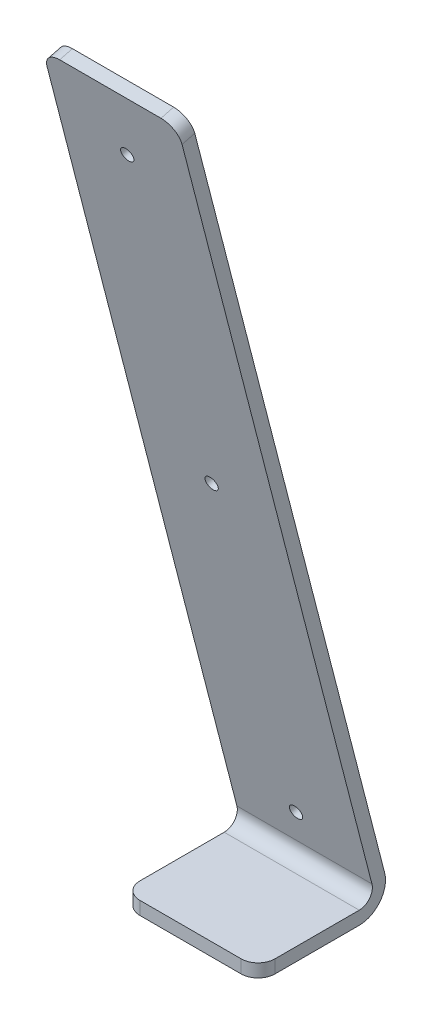
ISO-10303-21;
HEADER;
FILE_DESCRIPTION(('STEP AP214'),'2;1');
FILE_NAME('part.step','',(''),(''),'','','');
FILE_SCHEMA(('AUTOMOTIVE_DESIGN { 1 0 10303 214 1 1 1 1 }'));
ENDSEC;
DATA;
#1=APPLICATION_CONTEXT('core data for automotive mechanical design processes');
#2=APPLICATION_PROTOCOL_DEFINITION('international standard','automotive_design',2000,#1);
#3=PRODUCT_CONTEXT('',#1,'mechanical');
#4=PRODUCT('Part','Part','',(#3));
#5=PRODUCT_RELATED_PRODUCT_CATEGORY('part','',(#4));
#6=PRODUCT_DEFINITION_FORMATION('','',#4);
#7=PRODUCT_DEFINITION_CONTEXT('part definition',#1,'design');
#8=PRODUCT_DEFINITION('design','',#6,#7);
#9=PRODUCT_DEFINITION_SHAPE('','',#8);
#10=(LENGTH_UNIT() NAMED_UNIT(*) SI_UNIT(.MILLI.,.METRE.));
#11=(NAMED_UNIT(*) PLANE_ANGLE_UNIT() SI_UNIT($,.RADIAN.));
#12=(NAMED_UNIT(*) SI_UNIT($,.STERADIAN.) SOLID_ANGLE_UNIT());
#13=UNCERTAINTY_MEASURE_WITH_UNIT(LENGTH_MEASURE(1.E-05),#10,'distance_accuracy_value','');
#14=(GEOMETRIC_REPRESENTATION_CONTEXT(3) GLOBAL_UNCERTAINTY_ASSIGNED_CONTEXT((#13)) GLOBAL_UNIT_ASSIGNED_CONTEXT((#10,
#11,#12)) REPRESENTATION_CONTEXT('',''));
#15=CARTESIAN_POINT('',(0.,0.,0.));
#16=DIRECTION('',(0.,0.,1.));
#17=DIRECTION('',(1.,0.,0.));
#18=AXIS2_PLACEMENT_3D('',#15,#16,#17);
#19=CARTESIAN_POINT('',(-25.4,0.,-25.4));
#20=DIRECTION('',(0.,-1.,0.));
#21=DIRECTION('',(0.,0.,-1.));
#22=AXIS2_PLACEMENT_3D('',#19,#20,#21);
#23=PLANE('',#22);
#24=DIRECTION('',(0.,0.,1.));
#25=VECTOR('',#24,1.);
#26=CARTESIAN_POINT('',(25.4,0.,-49.2071645941862));
#27=LINE('',#26,#25);
#28=CARTESIAN_POINT('',(25.4,0.,-63.4573167534134));
#29=VERTEX_POINT('',#28);
#30=CARTESIAN_POINT('',(25.4,0.,-31.75));
#31=VERTEX_POINT('',#30);
#32=EDGE_CURVE('E108',#29,#31,#27,.T.);
#33=ORIENTED_EDGE('',*,*,#32,.T.);
#34=CARTESIAN_POINT('',(19.05,0.,-31.75));
#35=DIRECTION('',(0.,-1.,0.));
#36=DIRECTION('',(0.,0.,-1.));
#37=AXIS2_PLACEMENT_3D('',#34,#35,#36);
#38=CIRCLE('',#37,6.35);
#39=CARTESIAN_POINT('',(19.05,0.,-25.4));
#40=VERTEX_POINT('',#39);
#41=EDGE_CURVE('E20',#40,#31,#38,.F.);
#42=ORIENTED_EDGE('',*,*,#41,.F.);
#43=DIRECTION('',(-1.,0.,0.));
#44=VECTOR('',#43,1.);
#45=CARTESIAN_POINT('',(0.,0.,-25.4));
#46=LINE('',#45,#44);
#47=CARTESIAN_POINT('',(-19.05,0.,-25.4));
#48=VERTEX_POINT('',#47);
#49=EDGE_CURVE('E105',#40,#48,#46,.T.);
#50=ORIENTED_EDGE('',*,*,#49,.T.);
#51=CARTESIAN_POINT('',(-19.05,0.,-31.75));
#52=DIRECTION('',(0.,-1.,0.));
#53=DIRECTION('',(0.,0.,-1.));
#54=AXIS2_PLACEMENT_3D('',#51,#52,#53);
#55=CIRCLE('',#54,6.35);
#56=CARTESIAN_POINT('',(-25.4,0.,-31.75));
#57=VERTEX_POINT('',#56);
#58=EDGE_CURVE('E184',#57,#48,#55,.F.);
#59=ORIENTED_EDGE('',*,*,#58,.F.);
#60=DIRECTION('',(0.,0.,1.));
#61=VECTOR('',#60,1.);
#62=CARTESIAN_POINT('',(-25.4,0.,-49.2071645941862));
#63=LINE('',#62,#61);
#64=CARTESIAN_POINT('',(-25.4,0.,-63.4573167534134));
#65=VERTEX_POINT('',#64);
#66=EDGE_CURVE('E128',#65,#57,#63,.T.);
#67=ORIENTED_EDGE('',*,*,#66,.F.);
#68=DIRECTION('',(-1.,0.,0.));
#69=VECTOR('',#68,1.);
#70=CARTESIAN_POINT('',(-25.4,0.,-63.4573167534134));
#71=LINE('',#70,#69);
#72=EDGE_CURVE('E183',#29,#65,#71,.T.);
#73=ORIENTED_EDGE('',*,*,#72,.F.);
#74=EDGE_LOOP('',(#33,#42,#50,#59,#67,#73));
#75=FACE_BOUND('',#74,.T.);
#76=ADVANCED_FACE('F17',(#75),#23,.T.);
#77=CARTESIAN_POINT('',(19.05,608.96212742002,-31.75));
#78=DIRECTION('',(0.,-1.,0.));
#79=DIRECTION('',(0.,0.,-1.));
#80=AXIS2_PLACEMENT_3D('',#77,#78,#79);
#81=CYLINDRICAL_SURFACE('',#80,6.35);
#82=DIRECTION('',(0.,1.,0.));
#83=VECTOR('',#82,1.);
#84=CARTESIAN_POINT('',(19.05,2.46761,-25.4));
#85=LINE('',#84,#83);
#86=CARTESIAN_POINT('',(19.05,4.93522000000001,-25.4));
#87=VERTEX_POINT('',#86);
#88=EDGE_CURVE('E113',#87,#40,#85,.F.);
#89=ORIENTED_EDGE('',*,*,#88,.T.);
#90=ORIENTED_EDGE('',*,*,#41,.T.);
#91=DIRECTION('',(0.,1.,0.));
#92=VECTOR('',#91,1.);
#93=CARTESIAN_POINT('',(25.4,2.46761,-31.75));
#94=LINE('',#93,#92);
#95=CARTESIAN_POINT('',(25.4,4.93522000000001,-31.75));
#96=VERTEX_POINT('',#95);
#97=EDGE_CURVE('E129',#31,#96,#94,.T.);
#98=ORIENTED_EDGE('',*,*,#97,.T.);
#99=CARTESIAN_POINT('',(19.05,4.93522000000002,-31.75));
#100=DIRECTION('',(0.,-1.,0.));
#101=DIRECTION('',(0.,0.,-1.));
#102=AXIS2_PLACEMENT_3D('',#99,#100,#101);
#103=CIRCLE('',#102,6.35);
#104=EDGE_CURVE('E123',#96,#87,#103,.T.);
#105=ORIENTED_EDGE('',*,*,#104,.T.);
#106=EDGE_LOOP('',(#89,#90,#98,#105));
#107=FACE_BOUND('',#106,.T.);
#108=ADVANCED_FACE('F122',(#107),#81,.T.);
#109=CARTESIAN_POINT('',(0.,2.46761,-25.4));
#110=DIRECTION('',(0.,0.,-1.));
#111=DIRECTION('',(-1.,0.,0.));
#112=AXIS2_PLACEMENT_3D('',#109,#110,#111);
#113=PLANE('',#112);
#114=DIRECTION('',(0.,-1.,0.));
#115=VECTOR('',#114,1.);
#116=CARTESIAN_POINT('',(-19.05,608.694350914172,-25.4));
#117=LINE('',#116,#115);
#118=CARTESIAN_POINT('',(-19.05,4.93522000000001,-25.4));
#119=VERTEX_POINT('',#118);
#120=EDGE_CURVE('E119',#48,#119,#117,.F.);
#121=ORIENTED_EDGE('',*,*,#120,.F.);
#122=ORIENTED_EDGE('',*,*,#49,.F.);
#123=ORIENTED_EDGE('',*,*,#88,.F.);
#124=DIRECTION('',(1.,0.,0.));
#125=VECTOR('',#124,1.);
#126=CARTESIAN_POINT('',(-25.4,4.93522,-25.4));
#127=LINE('',#126,#125);
#128=EDGE_CURVE('E180',#87,#119,#127,.F.);
#129=ORIENTED_EDGE('',*,*,#128,.T.);
#130=EDGE_LOOP('',(#121,#122,#123,#129));
#131=FACE_BOUND('',#130,.T.);
#132=ADVANCED_FACE('F116',(#131),#113,.F.);
#133=CARTESIAN_POINT('',(-19.05,608.694350914172,-31.75));
#134=DIRECTION('',(0.,-1.,0.));
#135=DIRECTION('',(0.,0.,-1.));
#136=AXIS2_PLACEMENT_3D('',#133,#134,#135);
#137=CYLINDRICAL_SURFACE('',#136,6.35);
#138=DIRECTION('',(0.,1.,0.));
#139=VECTOR('',#138,1.);
#140=CARTESIAN_POINT('',(-25.4,2.46761,-31.75));
#141=LINE('',#140,#139);
#142=CARTESIAN_POINT('',(-25.4,4.93522000000001,-31.75));
#143=VERTEX_POINT('',#142);
#144=EDGE_CURVE('E201',#57,#143,#141,.T.);
#145=ORIENTED_EDGE('',*,*,#144,.F.);
#146=ORIENTED_EDGE('',*,*,#58,.T.);
#147=ORIENTED_EDGE('',*,*,#120,.T.);
#148=CARTESIAN_POINT('',(-19.05,4.93522000000002,-31.75));
#149=DIRECTION('',(0.,-1.,0.));
#150=DIRECTION('',(0.,0.,-1.));
#151=AXIS2_PLACEMENT_3D('',#148,#149,#150);
#152=CIRCLE('',#151,6.35);
#153=EDGE_CURVE('E176',#119,#143,#152,.T.);
#154=ORIENTED_EDGE('',*,*,#153,.T.);
#155=EDGE_LOOP('',(#145,#146,#147,#154));
#156=FACE_BOUND('',#155,.T.);
#157=ADVANCED_FACE('F189',(#156),#137,.T.);
#158=CARTESIAN_POINT('',(-25.4,9.87044,-63.4573167534134));
#159=DIRECTION('',(-1.,0.,0.));
#160=DIRECTION('',(0.,0.,1.));
#161=AXIS2_PLACEMENT_3D('',#158,#159,#160);
#162=CYLINDRICAL_SURFACE('',#161,9.87044);
#163=CARTESIAN_POINT('',(-25.4,9.87044,-63.4573167534134));
#164=DIRECTION('',(-1.,0.,0.));
#165=DIRECTION('',(0.,0.,1.));
#166=AXIS2_PLACEMENT_3D('',#163,#164,#165);
#167=CIRCLE('',#166,9.87044);
#168=CARTESIAN_POINT('',(-25.4,12.3380500000012,-73.0143291883508));
#169=VERTEX_POINT('',#168);
#170=EDGE_CURVE('E172',#65,#169,#167,.F.);
#171=ORIENTED_EDGE('',*,*,#170,.T.);
#172=DIRECTION('',(1.,0.,0.));
#173=VECTOR('',#172,1.);
#174=CARTESIAN_POINT('',(-25.4,12.338050000002,-73.0143291883547));
#175=LINE('',#174,#173);
#176=CARTESIAN_POINT('',(25.4,12.3380500000012,-73.0143291883508));
#177=VERTEX_POINT('',#176);
#178=EDGE_CURVE('E171',#177,#169,#175,.F.);
#179=ORIENTED_EDGE('',*,*,#178,.F.);
#180=CARTESIAN_POINT('',(25.4,9.87044,-63.4573167534134));
#181=DIRECTION('',(-1.,0.,0.));
#182=DIRECTION('',(0.,0.,1.));
#183=AXIS2_PLACEMENT_3D('',#180,#181,#182);
#184=CIRCLE('',#183,9.87044);
#185=EDGE_CURVE('E182',#29,#177,#184,.F.);
#186=ORIENTED_EDGE('',*,*,#185,.F.);
#187=ORIENTED_EDGE('',*,*,#72,.T.);
#188=EDGE_LOOP('',(#171,#179,#186,#187));
#189=FACE_BOUND('',#188,.T.);
#190=ADVANCED_FACE('F212',(#189),#162,.T.);
#191=CARTESIAN_POINT('',(-25.4,4.93522,-25.4));
#192=DIRECTION('',(0.,-1.,0.));
#193=DIRECTION('',(0.,0.,-1.));
#194=AXIS2_PLACEMENT_3D('',#191,#192,#193);
#195=PLANE('',#194);
#196=DIRECTION('',(-1.,0.,0.));
#197=VECTOR('',#196,1.);
#198=CARTESIAN_POINT('',(-25.4,4.93522,-63.4573167534134));
#199=LINE('',#198,#197);
#200=CARTESIAN_POINT('',(25.4,4.93522,-63.4573167534134));
#201=VERTEX_POINT('',#200);
#202=CARTESIAN_POINT('',(-25.4,4.93522,-63.4573167534134));
#203=VERTEX_POINT('',#202);
#204=EDGE_CURVE('E163',#201,#203,#199,.T.);
#205=ORIENTED_EDGE('',*,*,#204,.T.);
#206=DIRECTION('',(0.,0.,-1.));
#207=VECTOR('',#206,1.);
#208=CARTESIAN_POINT('',(-25.4,4.93522,-25.4));
#209=LINE('',#208,#207);
#210=EDGE_CURVE('E179',#143,#203,#209,.T.);
#211=ORIENTED_EDGE('',*,*,#210,.F.);
#212=ORIENTED_EDGE('',*,*,#153,.F.);
#213=ORIENTED_EDGE('',*,*,#128,.F.);
#214=ORIENTED_EDGE('',*,*,#104,.F.);
#215=DIRECTION('',(0.,0.,-1.));
#216=VECTOR('',#215,1.);
#217=CARTESIAN_POINT('',(25.4,4.93522,-25.4));
#218=LINE('',#217,#216);
#219=EDGE_CURVE('E175',#201,#96,#218,.F.);
#220=ORIENTED_EDGE('',*,*,#219,.F.);
#221=EDGE_LOOP('',(#205,#211,#212,#213,#214,#220));
#222=FACE_BOUND('',#221,.T.);
#223=ADVANCED_FACE('F193',(#222),#195,.F.);
#224=CARTESIAN_POINT('',(-25.4,0.,-76.2));
#225=DIRECTION('',(0.,0.249999999999989,-0.968245836551857));
#226=DIRECTION('',(0.,0.968245836551857,0.249999999999989));
#227=AXIS2_PLACEMENT_3D('',#224,#225,#226);
#228=PLANE('',#227);
#229=CARTESIAN_POINT('',(0.,270.52788673258,-6.35000000000626));
#230=DIRECTION('',(0.,-0.249999999999989,0.968245836551857));
#231=DIRECTION('',(0.,-0.968245836551857,-0.249999999999989));
#232=AXIS2_PLACEMENT_3D('',#229,#230,#231);
#233=CIRCLE('',#232,2.4384);
#234=CARTESIAN_POINT('',(0.,268.166916084732,-6.95960000000624));
#235=VERTEX_POINT('',#234);
#236=EDGE_CURVE('E145',#235,#235,#233,.T.);
#237=ORIENTED_EDGE('',*,*,#236,.T.);
#238=EDGE_LOOP('',(#237));
#239=FACE_BOUND('',#238,.T.);
#240=CARTESIAN_POINT('',(0.,147.560665490499,-38.1000000000001));
#241=DIRECTION('',(0.,-0.249999999999989,0.968245836551857));
#242=DIRECTION('',(0.,-0.968245836551857,-0.249999999999989));
#243=AXIS2_PLACEMENT_3D('',#240,#241,#242);
#244=CIRCLE('',#243,2.4384);
#245=CARTESIAN_POINT('',(0.,145.199694842651,-38.7096000000001));
#246=VERTEX_POINT('',#245);
#247=EDGE_CURVE('E148',#246,#246,#244,.T.);
#248=ORIENTED_EDGE('',*,*,#247,.T.);
#249=EDGE_LOOP('',(#248));
#250=FACE_BOUND('',#249,.T.);
#251=CARTESIAN_POINT('',(0.,24.5934442484184,-69.8500000000007));
#252=DIRECTION('',(0.,-0.249999999999989,0.968245836551857));
#253=DIRECTION('',(0.,-0.968245836551857,-0.249999999999989));
#254=AXIS2_PLACEMENT_3D('',#251,#252,#253);
#255=CIRCLE('',#254,2.4384);
#256=CARTESIAN_POINT('',(0.,22.2324736005704,-70.4596000000007));
#257=VERTEX_POINT('',#256);
#258=EDGE_CURVE('E151',#257,#257,#255,.T.);
#259=ORIENTED_EDGE('',*,*,#258,.T.);
#260=EDGE_LOOP('',(#259));
#261=FACE_BOUND('',#260,.T.);
#262=DIRECTION('',(1.,0.,0.));
#263=VECTOR('',#262,1.);
#264=CARTESIAN_POINT('',(0.,295.121330980948,0.));
#265=LINE('',#264,#263);
#266=CARTESIAN_POINT('',(19.05,295.121330980946,6.18363867055383E-12));
#267=VERTEX_POINT('',#266);
#268=CARTESIAN_POINT('',(-19.05,295.121330980948,0.));
#269=VERTEX_POINT('',#268);
#270=EDGE_CURVE('E158',#267,#269,#265,.F.);
#271=ORIENTED_EDGE('',*,*,#270,.F.);
#272=CARTESIAN_POINT('',(19.05,288.972969918923,-1.58749999996624));
#273=DIRECTION('',(0.,0.249999999999989,-0.968245836551857));
#274=DIRECTION('',(0.,0.968245836551857,0.249999999999989));
#275=AXIS2_PLACEMENT_3D('',#272,#273,#274);
#276=CIRCLE('',#275,6.35);
#277=CARTESIAN_POINT('',(25.4,288.972969918857,-1.58749999998316));
#278=VERTEX_POINT('',#277);
#279=EDGE_CURVE('E168',#278,#267,#276,.F.);
#280=ORIENTED_EDGE('',*,*,#279,.F.);
#281=DIRECTION('',(0.,-0.968245836551837,-0.250000000000066));
#282=VECTOR('',#281,1.);
#283=CARTESIAN_POINT('',(25.4,288.972969918792,-1.5875));
#284=LINE('',#283,#282);
#285=EDGE_CURVE('E167',#278,#177,#284,.T.);
#286=ORIENTED_EDGE('',*,*,#285,.T.);
#287=ORIENTED_EDGE('',*,*,#178,.T.);
#288=DIRECTION('',(0.,-0.968245836551837,-0.250000000000066));
#289=VECTOR('',#288,1.);
#290=CARTESIAN_POINT('',(-25.4,288.972969918792,-1.5875));
#291=LINE('',#290,#289);
#292=CARTESIAN_POINT('',(-25.4,288.972969918859,-1.58749999998934));
#293=VERTEX_POINT('',#292);
#294=EDGE_CURVE('E162',#293,#169,#291,.T.);
#295=ORIENTED_EDGE('',*,*,#294,.F.);
#296=CARTESIAN_POINT('',(-19.05,288.972969918926,-1.58749999997866));
#297=DIRECTION('',(0.,0.249999999999989,-0.968245836551857));
#298=DIRECTION('',(0.,0.968245836551857,0.249999999999989));
#299=AXIS2_PLACEMENT_3D('',#296,#297,#298);
#300=CIRCLE('',#299,6.35);
#301=EDGE_CURVE('E155',#269,#293,#300,.F.);
#302=ORIENTED_EDGE('',*,*,#301,.F.);
#303=EDGE_LOOP('',(#271,#280,#286,#287,#295,#302));
#304=FACE_BOUND('',#303,.T.);
#305=ADVANCED_FACE('F345',(#239,#250,#261,#304),#228,.T.);
#306=CARTESIAN_POINT('',(19.05,260.313805510286,109.408966470911));
#307=DIRECTION('',(0.,0.249999999999989,-0.968245836551857));
#308=DIRECTION('',(0.,0.968245836551857,0.249999999999989));
#309=AXIS2_PLACEMENT_3D('',#306,#307,#308);
#310=CYLINDRICAL_SURFACE('',#309,6.35);
#311=DIRECTION('',(0.,0.250000000000027,-0.968245836551847));
#312=VECTOR('',#311,1.);
#313=CARTESIAN_POINT('',(25.4,287.739164918792,3.1910062174668));
#314=LINE('',#313,#312);
#315=CARTESIAN_POINT('',(25.4,287.739164918863,3.19100621746266));
#316=VERTEX_POINT('',#315);
#317=EDGE_CURVE('E170',#316,#278,#314,.T.);
#318=ORIENTED_EDGE('',*,*,#317,.T.);
#319=ORIENTED_EDGE('',*,*,#279,.T.);
#320=DIRECTION('',(0.,-0.249999999999989,0.968245836551857));
#321=VECTOR('',#320,1.);
#322=CARTESIAN_POINT('',(19.05,294.504428480948,2.38925310873365));
#323=LINE('',#322,#321);
#324=CARTESIAN_POINT('',(19.05,293.88752598095,4.7785062174582));
#325=VERTEX_POINT('',#324);
#326=EDGE_CURVE('E154',#325,#267,#323,.F.);
#327=ORIENTED_EDGE('',*,*,#326,.F.);
#328=CARTESIAN_POINT('',(19.05,287.739164918926,3.19100621748819));
#329=DIRECTION('',(0.,0.249999999999989,-0.968245836551857));
#330=DIRECTION('',(0.,0.968245836551857,0.249999999999989));
#331=AXIS2_PLACEMENT_3D('',#328,#329,#330);
#332=CIRCLE('',#331,6.35);
#333=EDGE_CURVE('E141',#325,#316,#332,.T.);
#334=ORIENTED_EDGE('',*,*,#333,.T.);
#335=EDGE_LOOP('',(#318,#319,#327,#334));
#336=FACE_BOUND('',#335,.T.);
#337=ADVANCED_FACE('F258',(#336),#310,.T.);
#338=CARTESIAN_POINT('',(25.4,148.486019240499,-35.3125380398068));
#339=DIRECTION('',(-1.,0.,0.));
#340=DIRECTION('',(0.,0.,1.));
#341=AXIS2_PLACEMENT_3D('',#338,#339,#340);
#342=PLANE('',#341);
#343=DIRECTION('',(0.,0.968245836551857,0.249999999999989));
#344=VECTOR('',#343,1.);
#345=CARTESIAN_POINT('',(25.4,-1.233805,-71.4214937825332));
#346=LINE('',#345,#344);
#347=CARTESIAN_POINT('',(25.4,11.104245000001,-68.2358229708844));
#348=VERTEX_POINT('',#347);
#349=EDGE_CURVE('E144',#316,#348,#346,.F.);
#350=ORIENTED_EDGE('',*,*,#349,.T.);
#351=CARTESIAN_POINT('',(25.4,9.87044,-63.4573167534134));
#352=DIRECTION('',(-1.,0.,0.));
#353=DIRECTION('',(0.,0.,1.));
#354=AXIS2_PLACEMENT_3D('',#351,#352,#353);
#355=CIRCLE('',#354,4.93522);
#356=EDGE_CURVE('E164',#348,#201,#355,.T.);
#357=ORIENTED_EDGE('',*,*,#356,.T.);
#358=ORIENTED_EDGE('',*,*,#219,.T.);
#359=ORIENTED_EDGE('',*,*,#97,.F.);
#360=ORIENTED_EDGE('',*,*,#32,.F.);
#361=ORIENTED_EDGE('',*,*,#185,.T.);
#362=ORIENTED_EDGE('',*,*,#285,.F.);
#363=ORIENTED_EDGE('',*,*,#317,.F.);
#364=EDGE_LOOP('',(#350,#357,#358,#359,#360,#361,#362,#363));
#365=FACE_BOUND('',#364,.T.);
#366=ADVANCED_FACE('F216',(#365),#342,.F.);
#367=CARTESIAN_POINT('',(-25.4,9.87044,-63.4573167534134));
#368=DIRECTION('',(-1.,0.,0.));
#369=DIRECTION('',(0.,0.,1.));
#370=AXIS2_PLACEMENT_3D('',#367,#368,#369);
#371=CYLINDRICAL_SURFACE('',#370,4.93522);
#372=ORIENTED_EDGE('',*,*,#204,.F.);
#373=ORIENTED_EDGE('',*,*,#356,.F.);
#374=DIRECTION('',(1.,0.,0.));
#375=VECTOR('',#374,1.);
#376=CARTESIAN_POINT('',(-25.4,11.104245000002,-68.2358229708879));
#377=LINE('',#376,#375);
#378=CARTESIAN_POINT('',(-25.4,11.104245000001,-68.2358229708844));
#379=VERTEX_POINT('',#378);
#380=EDGE_CURVE('E226',#348,#379,#377,.F.);
#381=ORIENTED_EDGE('',*,*,#380,.T.);
#382=CARTESIAN_POINT('',(-25.4,9.87044,-63.4573167534134));
#383=DIRECTION('',(-1.,0.,0.));
#384=DIRECTION('',(0.,0.,1.));
#385=AXIS2_PLACEMENT_3D('',#382,#383,#384);
#386=CIRCLE('',#385,4.93522);
#387=EDGE_CURVE('E160',#203,#379,#386,.F.);
#388=ORIENTED_EDGE('',*,*,#387,.F.);
#389=EDGE_LOOP('',(#372,#373,#381,#388));
#390=FACE_BOUND('',#389,.T.);
#391=ADVANCED_FACE('F249',(#390),#371,.F.);
#392=CARTESIAN_POINT('',(-25.4,148.486019240499,-35.3125380398068));
#393=DIRECTION('',(-1.,0.,0.));
#394=DIRECTION('',(0.,0.,1.));
#395=AXIS2_PLACEMENT_3D('',#392,#393,#394);
#396=PLANE('',#395);
#397=DIRECTION('',(0.,0.968245836551857,0.249999999999989));
#398=VECTOR('',#397,1.);
#399=CARTESIAN_POINT('',(-25.4,-1.233805,-71.4214937825332));
#400=LINE('',#399,#398);
#401=CARTESIAN_POINT('',(-25.4,287.739164918862,3.19100621746892));
#402=VERTEX_POINT('',#401);
#403=EDGE_CURVE('E140',#379,#402,#400,.T.);
#404=ORIENTED_EDGE('',*,*,#403,.T.);
#405=DIRECTION('',(0.,0.249999999999989,-0.968245836551857));
#406=VECTOR('',#405,1.);
#407=CARTESIAN_POINT('',(-25.4,260.313805510155,109.408966470877));
#408=LINE('',#407,#406);
#409=EDGE_CURVE('E159',#293,#402,#408,.F.);
#410=ORIENTED_EDGE('',*,*,#409,.F.);
#411=ORIENTED_EDGE('',*,*,#294,.T.);
#412=ORIENTED_EDGE('',*,*,#170,.F.);
#413=ORIENTED_EDGE('',*,*,#66,.T.);
#414=ORIENTED_EDGE('',*,*,#144,.T.);
#415=ORIENTED_EDGE('',*,*,#210,.T.);
#416=ORIENTED_EDGE('',*,*,#387,.T.);
#417=EDGE_LOOP('',(#404,#410,#411,#412,#413,#414,#415,#416));
#418=FACE_BOUND('',#417,.T.);
#419=ADVANCED_FACE('F204',(#418),#396,.T.);
#420=CARTESIAN_POINT('',(-19.05,260.313805510286,109.408966470911));
#421=DIRECTION('',(0.,0.249999999999989,-0.968245836551857));
#422=DIRECTION('',(0.,0.968245836551857,0.249999999999989));
#423=AXIS2_PLACEMENT_3D('',#420,#421,#422);
#424=CYLINDRICAL_SURFACE('',#423,6.35);
#425=DIRECTION('',(0.,-0.249999999999989,0.968245836551857));
#426=VECTOR('',#425,1.);
#427=CARTESIAN_POINT('',(-19.05,294.504428480948,2.38925310873365));
#428=LINE('',#427,#426);
#429=CARTESIAN_POINT('',(-19.05,293.887525980949,4.77850621746444));
#430=VERTEX_POINT('',#429);
#431=EDGE_CURVE('E35',#269,#430,#428,.T.);
#432=ORIENTED_EDGE('',*,*,#431,.F.);
#433=ORIENTED_EDGE('',*,*,#301,.T.);
#434=ORIENTED_EDGE('',*,*,#409,.T.);
#435=CARTESIAN_POINT('',(-19.05,287.739164918923,3.19100621750067));
#436=DIRECTION('',(0.,0.249999999999989,-0.968245836551857));
#437=DIRECTION('',(0.,0.968245836551857,0.249999999999989));
#438=AXIS2_PLACEMENT_3D('',#435,#436,#437);
#439=CIRCLE('',#438,6.35);
#440=EDGE_CURVE('E137',#402,#430,#439,.T.);
#441=ORIENTED_EDGE('',*,*,#440,.T.);
#442=EDGE_LOOP('',(#432,#433,#434,#441));
#443=FACE_BOUND('',#442,.T.);
#444=ADVANCED_FACE('F244',(#443),#424,.T.);
#445=CARTESIAN_POINT('',(0.,294.504428480948,2.38925310873365));
#446=DIRECTION('',(0.,0.968245836551857,0.249999999999989));
#447=DIRECTION('',(0.,-0.249999999999989,0.968245836551857));
#448=AXIS2_PLACEMENT_3D('',#445,#446,#447);
#449=PLANE('',#448);
#450=DIRECTION('',(1.,0.,0.));
#451=VECTOR('',#450,1.);
#452=CARTESIAN_POINT('',(-25.4,293.887525980952,4.77850621744957));
#453=LINE('',#452,#451);
#454=EDGE_CURVE('E136',#430,#325,#453,.T.);
#455=ORIENTED_EDGE('',*,*,#454,.T.);
#456=ORIENTED_EDGE('',*,*,#326,.T.);
#457=ORIENTED_EDGE('',*,*,#270,.T.);
#458=ORIENTED_EDGE('',*,*,#431,.T.);
#459=EDGE_LOOP('',(#455,#456,#457,#458));
#460=FACE_BOUND('',#459,.T.);
#461=ADVANCED_FACE('F235',(#460),#449,.T.);
#462=CARTESIAN_POINT('',(0.,24.5934442484183,-69.85));
#463=DIRECTION('',(0.,-0.249999999999989,0.968245836551857));
#464=DIRECTION('',(0.,-0.968245836551857,-0.249999999999989));
#465=AXIS2_PLACEMENT_3D('',#462,#463,#464);
#466=CYLINDRICAL_SURFACE('',#465,2.4384);
#467=CARTESIAN_POINT('',(0.,23.3596392484187,-65.0714937825339));
#468=DIRECTION('',(0.,-0.249999999999989,0.968245836551857));
#469=DIRECTION('',(0.,-0.968245836551857,-0.249999999999989));
#470=AXIS2_PLACEMENT_3D('',#467,#468,#469);
#471=CIRCLE('',#470,2.4384);
#472=CARTESIAN_POINT('',(0.,20.9986686005706,-65.6810937825338));
#473=VERTEX_POINT('',#472);
#474=EDGE_CURVE('E133',#473,#473,#471,.T.);
#475=ORIENTED_EDGE('',*,*,#474,.T.);
#476=EDGE_LOOP('',(#475));
#477=FACE_BOUND('',#476,.T.);
#478=ORIENTED_EDGE('',*,*,#258,.F.);
#479=EDGE_LOOP('',(#478));
#480=FACE_BOUND('',#479,.T.);
#481=ADVANCED_FACE('F275',(#477,#480),#466,.F.);
#482=CARTESIAN_POINT('',(0.,147.560665490499,-38.1));
#483=DIRECTION('',(0.,-0.249999999999989,0.968245836551857));
#484=DIRECTION('',(0.,-0.968245836551857,-0.249999999999989));
#485=AXIS2_PLACEMENT_3D('',#482,#483,#484);
#486=CYLINDRICAL_SURFACE('',#485,2.4384);
#487=CARTESIAN_POINT('',(0.,146.3268604905,-33.3214937825333));
#488=DIRECTION('',(0.,-0.249999999999989,0.968245836551857));
#489=DIRECTION('',(0.,-0.968245836551857,-0.249999999999989));
#490=AXIS2_PLACEMENT_3D('',#487,#488,#489);
#491=CIRCLE('',#490,2.4384);
#492=CARTESIAN_POINT('',(0.,143.965889842652,-33.9310937825332));
#493=VERTEX_POINT('',#492);
#494=EDGE_CURVE('E26',#493,#493,#491,.T.);
#495=ORIENTED_EDGE('',*,*,#494,.T.);
#496=EDGE_LOOP('',(#495));
#497=FACE_BOUND('',#496,.T.);
#498=ORIENTED_EDGE('',*,*,#247,.F.);
#499=EDGE_LOOP('',(#498));
#500=FACE_BOUND('',#499,.T.);
#501=ADVANCED_FACE('F267',(#497,#500),#486,.F.);
#502=CARTESIAN_POINT('',(0.,270.527886732578,-6.35));
#503=DIRECTION('',(0.,-0.249999999999989,0.968245836551857));
#504=DIRECTION('',(0.,-0.968245836551857,-0.249999999999989));
#505=AXIS2_PLACEMENT_3D('',#502,#503,#504);
#506=CYLINDRICAL_SURFACE('',#505,2.4384);
#507=CARTESIAN_POINT('',(0.,269.29408173258,-1.57149378253892));
#508=DIRECTION('',(0.,-0.249999999999989,0.968245836551857));
#509=DIRECTION('',(0.,-0.968245836551857,-0.249999999999989));
#510=AXIS2_PLACEMENT_3D('',#507,#508,#509);
#511=CIRCLE('',#510,2.4384);
#512=CARTESIAN_POINT('',(0.,266.933111084732,-2.18109378253889));
#513=VERTEX_POINT('',#512);
#514=EDGE_CURVE('E11',#513,#513,#511,.T.);
#515=ORIENTED_EDGE('',*,*,#514,.T.);
#516=EDGE_LOOP('',(#515));
#517=FACE_BOUND('',#516,.T.);
#518=ORIENTED_EDGE('',*,*,#236,.F.);
#519=EDGE_LOOP('',(#518));
#520=FACE_BOUND('',#519,.T.);
#521=ADVANCED_FACE('F261',(#517,#520),#506,.F.);
#522=CARTESIAN_POINT('',(-25.4,-1.233805,-71.4214937825332));
#523=DIRECTION('',(0.,0.249999999999989,-0.968245836551857));
#524=DIRECTION('',(0.,0.968245836551857,0.249999999999989));
#525=AXIS2_PLACEMENT_3D('',#522,#523,#524);
#526=PLANE('',#525);
#527=ORIENTED_EDGE('',*,*,#514,.F.);
#528=EDGE_LOOP('',(#527));
#529=FACE_BOUND('',#528,.T.);
#530=ORIENTED_EDGE('',*,*,#494,.F.);
#531=EDGE_LOOP('',(#530));
#532=FACE_BOUND('',#531,.T.);
#533=ORIENTED_EDGE('',*,*,#474,.F.);
#534=EDGE_LOOP('',(#533));
#535=FACE_BOUND('',#534,.T.);
#536=ORIENTED_EDGE('',*,*,#440,.F.);
#537=ORIENTED_EDGE('',*,*,#403,.F.);
#538=ORIENTED_EDGE('',*,*,#380,.F.);
#539=ORIENTED_EDGE('',*,*,#349,.F.);
#540=ORIENTED_EDGE('',*,*,#333,.F.);
#541=ORIENTED_EDGE('',*,*,#454,.F.);
#542=EDGE_LOOP('',(#536,#537,#538,#539,#540,#541));
#543=FACE_BOUND('',#542,.T.);
#544=ADVANCED_FACE('F240',(#529,#532,#535,#543),#526,.F.);
#545=CLOSED_SHELL('',(#76,#108,#132,#157,#190,#223,#305,#337,#366,#391,#419,#444,#461,#481,#501,
#521,#544));
#546=MANIFOLD_SOLID_BREP('B1',#545);
#547=ADVANCED_BREP_SHAPE_REPRESENTATION('',(#18,#546),#14);
#548=SHAPE_DEFINITION_REPRESENTATION(#9,#547);
ENDSEC;
END-ISO-10303-21;
